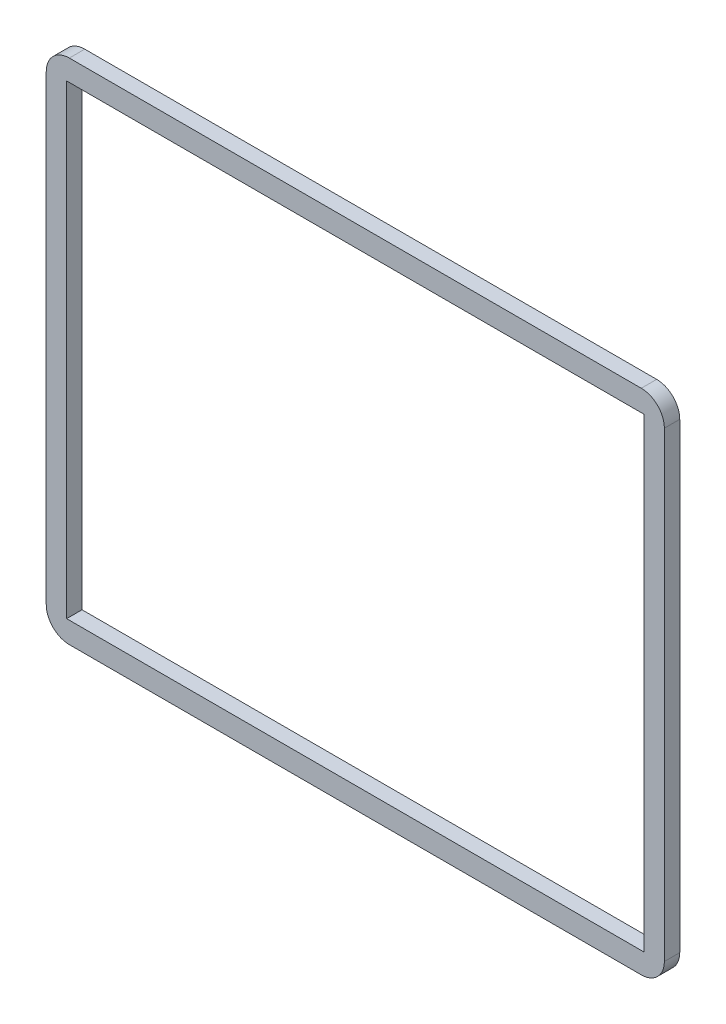
ISO-10303-21;
HEADER;
FILE_DESCRIPTION(('STEP AP214'),'2;1');
FILE_NAME('part.step','',(''),(''),'','','');
FILE_SCHEMA(('AUTOMOTIVE_DESIGN { 1 0 10303 214 1 1 1 1 }'));
ENDSEC;
DATA;
#1=APPLICATION_CONTEXT('core data for automotive mechanical design processes');
#2=APPLICATION_PROTOCOL_DEFINITION('international standard','automotive_design',2000,#1);
#3=PRODUCT_CONTEXT('',#1,'mechanical');
#4=PRODUCT('Part','Part','',(#3));
#5=PRODUCT_RELATED_PRODUCT_CATEGORY('part','',(#4));
#6=PRODUCT_DEFINITION_FORMATION('','',#4);
#7=PRODUCT_DEFINITION_CONTEXT('part definition',#1,'design');
#8=PRODUCT_DEFINITION('design','',#6,#7);
#9=PRODUCT_DEFINITION_SHAPE('','',#8);
#10=(LENGTH_UNIT() NAMED_UNIT(*) SI_UNIT(.MILLI.,.METRE.));
#11=(NAMED_UNIT(*) PLANE_ANGLE_UNIT() SI_UNIT($,.RADIAN.));
#12=(NAMED_UNIT(*) SI_UNIT($,.STERADIAN.) SOLID_ANGLE_UNIT());
#13=UNCERTAINTY_MEASURE_WITH_UNIT(LENGTH_MEASURE(1.E-05),#10,'distance_accuracy_value','');
#14=(GEOMETRIC_REPRESENTATION_CONTEXT(3) GLOBAL_UNCERTAINTY_ASSIGNED_CONTEXT((#13)) GLOBAL_UNIT_ASSIGNED_CONTEXT((#10,
#11,#12)) REPRESENTATION_CONTEXT('',''));
#15=CARTESIAN_POINT('',(0.,0.,0.));
#16=DIRECTION('',(0.,0.,1.));
#17=DIRECTION('',(1.,0.,0.));
#18=AXIS2_PLACEMENT_3D('',#15,#16,#17);
#19=CARTESIAN_POINT('',(0.,0.,2.));
#20=DIRECTION('',(1.,0.,0.));
#21=DIRECTION('',(0.,0.,-1.));
#22=AXIS2_PLACEMENT_3D('',#19,#20,#21);
#23=PLANE('',#22);
#24=DIRECTION('',(0.,-1.,0.));
#25=VECTOR('',#24,1.);
#26=CARTESIAN_POINT('',(0.,0.,0.));
#27=LINE('',#26,#25);
#28=CARTESIAN_POINT('',(0.,63.,0.));
#29=VERTEX_POINT('',#28);
#30=CARTESIAN_POINT('',(0.,3.,0.));
#31=VERTEX_POINT('',#30);
#32=EDGE_CURVE('E153',#29,#31,#27,.T.);
#33=ORIENTED_EDGE('',*,*,#32,.T.);
#34=DIRECTION('',(0.,0.,-1.));
#35=VECTOR('',#34,1.);
#36=CARTESIAN_POINT('',(0.,3.,2.));
#37=LINE('',#36,#35);
#38=CARTESIAN_POINT('',(0.,3.,2.));
#39=VERTEX_POINT('',#38);
#40=EDGE_CURVE('E11',#31,#39,#37,.F.);
#41=ORIENTED_EDGE('',*,*,#40,.T.);
#42=DIRECTION('',(0.,-1.,0.));
#43=VECTOR('',#42,1.);
#44=CARTESIAN_POINT('',(0.,0.,2.));
#45=LINE('',#44,#43);
#46=CARTESIAN_POINT('',(0.,63.,2.));
#47=VERTEX_POINT('',#46);
#48=EDGE_CURVE('E157',#47,#39,#45,.T.);
#49=ORIENTED_EDGE('',*,*,#48,.F.);
#50=DIRECTION('',(0.,0.,-1.));
#51=VECTOR('',#50,1.);
#52=CARTESIAN_POINT('',(0.,63.,2.));
#53=LINE('',#52,#51);
#54=EDGE_CURVE('E40',#47,#29,#53,.T.);
#55=ORIENTED_EDGE('',*,*,#54,.T.);
#56=EDGE_LOOP('',(#33,#41,#49,#55));
#57=FACE_BOUND('',#56,.T.);
#58=ADVANCED_FACE('F32',(#57),#23,.F.);
#59=CARTESIAN_POINT('',(0.,0.,2.));
#60=DIRECTION('',(0.,1.,0.));
#61=DIRECTION('',(0.,0.,1.));
#62=AXIS2_PLACEMENT_3D('',#59,#60,#61);
#63=PLANE('',#62);
#64=DIRECTION('',(1.,0.,0.));
#65=VECTOR('',#64,1.);
#66=CARTESIAN_POINT('',(0.,0.,0.));
#67=LINE('',#66,#65);
#68=CARTESIAN_POINT('',(3.,0.,0.));
#69=VERTEX_POINT('',#68);
#70=CARTESIAN_POINT('',(77.3,0.,0.));
#71=VERTEX_POINT('',#70);
#72=EDGE_CURVE('E173',#69,#71,#67,.T.);
#73=ORIENTED_EDGE('',*,*,#72,.T.);
#74=DIRECTION('',(0.,0.,-1.));
#75=VECTOR('',#74,1.);
#76=CARTESIAN_POINT('',(77.3,0.,2.));
#77=LINE('',#76,#75);
#78=CARTESIAN_POINT('',(77.3,0.,2.));
#79=VERTEX_POINT('',#78);
#80=EDGE_CURVE('E209',#71,#79,#77,.F.);
#81=ORIENTED_EDGE('',*,*,#80,.T.);
#82=DIRECTION('',(1.,0.,0.));
#83=VECTOR('',#82,1.);
#84=CARTESIAN_POINT('',(0.,0.,2.));
#85=LINE('',#84,#83);
#86=CARTESIAN_POINT('',(3.,0.,2.));
#87=VERTEX_POINT('',#86);
#88=EDGE_CURVE('E160',#87,#79,#85,.T.);
#89=ORIENTED_EDGE('',*,*,#88,.F.);
#90=DIRECTION('',(0.,0.,-1.));
#91=VECTOR('',#90,1.);
#92=CARTESIAN_POINT('',(3.,0.,2.));
#93=LINE('',#92,#91);
#94=EDGE_CURVE('E206',#87,#69,#93,.T.);
#95=ORIENTED_EDGE('',*,*,#94,.T.);
#96=EDGE_LOOP('',(#73,#81,#89,#95));
#97=FACE_BOUND('',#96,.T.);
#98=ADVANCED_FACE('F226',(#97),#63,.F.);
#99=CARTESIAN_POINT('',(80.3,0.,2.));
#100=DIRECTION('',(-1.,0.,0.));
#101=DIRECTION('',(0.,0.,1.));
#102=AXIS2_PLACEMENT_3D('',#99,#100,#101);
#103=PLANE('',#102);
#104=DIRECTION('',(0.,1.,0.));
#105=VECTOR('',#104,1.);
#106=CARTESIAN_POINT('',(80.3,0.,0.));
#107=LINE('',#106,#105);
#108=CARTESIAN_POINT('',(80.3,3.,0.));
#109=VERTEX_POINT('',#108);
#110=CARTESIAN_POINT('',(80.3,63.,0.));
#111=VERTEX_POINT('',#110);
#112=EDGE_CURVE('E176',#109,#111,#107,.T.);
#113=ORIENTED_EDGE('',*,*,#112,.T.);
#114=DIRECTION('',(0.,0.,-1.));
#115=VECTOR('',#114,1.);
#116=CARTESIAN_POINT('',(80.3,63.,2.));
#117=LINE('',#116,#115);
#118=CARTESIAN_POINT('',(80.3,63.,2.));
#119=VERTEX_POINT('',#118);
#120=EDGE_CURVE('E196',#111,#119,#117,.F.);
#121=ORIENTED_EDGE('',*,*,#120,.T.);
#122=DIRECTION('',(0.,1.,0.));
#123=VECTOR('',#122,1.);
#124=CARTESIAN_POINT('',(80.3,0.,2.));
#125=LINE('',#124,#123);
#126=CARTESIAN_POINT('',(80.3,3.,2.));
#127=VERTEX_POINT('',#126);
#128=EDGE_CURVE('E164',#127,#119,#125,.T.);
#129=ORIENTED_EDGE('',*,*,#128,.F.);
#130=DIRECTION('',(0.,0.,-1.));
#131=VECTOR('',#130,1.);
#132=CARTESIAN_POINT('',(80.3,3.,2.));
#133=LINE('',#132,#131);
#134=EDGE_CURVE('E193',#127,#109,#133,.T.);
#135=ORIENTED_EDGE('',*,*,#134,.T.);
#136=EDGE_LOOP('',(#113,#121,#129,#135));
#137=FACE_BOUND('',#136,.T.);
#138=ADVANCED_FACE('F237',(#137),#103,.F.);
#139=CARTESIAN_POINT('',(0.,66.,2.));
#140=DIRECTION('',(0.,-1.,0.));
#141=DIRECTION('',(0.,0.,-1.));
#142=AXIS2_PLACEMENT_3D('',#139,#140,#141);
#143=PLANE('',#142);
#144=DIRECTION('',(-1.,0.,0.));
#145=VECTOR('',#144,1.);
#146=CARTESIAN_POINT('',(0.,66.,2.));
#147=LINE('',#146,#145);
#148=CARTESIAN_POINT('',(77.3,66.,2.));
#149=VERTEX_POINT('',#148);
#150=CARTESIAN_POINT('',(3.,66.,2.));
#151=VERTEX_POINT('',#150);
#152=EDGE_CURVE('E167',#149,#151,#147,.T.);
#153=ORIENTED_EDGE('',*,*,#152,.F.);
#154=DIRECTION('',(0.,0.,-1.));
#155=VECTOR('',#154,1.);
#156=CARTESIAN_POINT('',(77.3,66.,2.));
#157=LINE('',#156,#155);
#158=CARTESIAN_POINT('',(77.3,66.,0.));
#159=VERTEX_POINT('',#158);
#160=EDGE_CURVE('E182',#149,#159,#157,.T.);
#161=ORIENTED_EDGE('',*,*,#160,.T.);
#162=DIRECTION('',(-1.,0.,0.));
#163=VECTOR('',#162,1.);
#164=CARTESIAN_POINT('',(0.,66.,0.));
#165=LINE('',#164,#163);
#166=CARTESIAN_POINT('',(3.,66.,0.));
#167=VERTEX_POINT('',#166);
#168=EDGE_CURVE('E161',#159,#167,#165,.T.);
#169=ORIENTED_EDGE('',*,*,#168,.T.);
#170=DIRECTION('',(0.,0.,-1.));
#171=VECTOR('',#170,1.);
#172=CARTESIAN_POINT('',(3.,66.,2.));
#173=LINE('',#172,#171);
#174=EDGE_CURVE('E170',#167,#151,#173,.F.);
#175=ORIENTED_EDGE('',*,*,#174,.T.);
#176=EDGE_LOOP('',(#153,#161,#169,#175));
#177=FACE_BOUND('',#176,.T.);
#178=ADVANCED_FACE('F245',(#177),#143,.F.);
#179=CARTESIAN_POINT('',(0.,0.,2.));
#180=DIRECTION('',(0.,0.,-1.));
#181=DIRECTION('',(-1.,0.,0.));
#182=AXIS2_PLACEMENT_3D('',#179,#180,#181);
#183=PLANE('',#182);
#184=DIRECTION('',(1.,0.,0.));
#185=VECTOR('',#184,1.);
#186=CARTESIAN_POINT('',(2.65000000000001,2.75,2.));
#187=LINE('',#186,#185);
#188=CARTESIAN_POINT('',(2.65000000000001,2.75,2.));
#189=VERTEX_POINT('',#188);
#190=CARTESIAN_POINT('',(77.65,2.75000000000001,2.));
#191=VERTEX_POINT('',#190);
#192=EDGE_CURVE('E147',#189,#191,#187,.T.);
#193=ORIENTED_EDGE('',*,*,#192,.F.);
#194=DIRECTION('',(0.,-1.,0.));
#195=VECTOR('',#194,1.);
#196=CARTESIAN_POINT('',(2.65000000000001,2.75,2.));
#197=LINE('',#196,#195);
#198=CARTESIAN_POINT('',(2.65000000000001,63.25,2.));
#199=VERTEX_POINT('',#198);
#200=EDGE_CURVE('E47',#199,#189,#197,.T.);
#201=ORIENTED_EDGE('',*,*,#200,.F.);
#202=DIRECTION('',(-1.,0.,0.));
#203=VECTOR('',#202,1.);
#204=CARTESIAN_POINT('',(2.65000000000001,63.25,2.));
#205=LINE('',#204,#203);
#206=CARTESIAN_POINT('',(77.65,63.25,2.));
#207=VERTEX_POINT('',#206);
#208=EDGE_CURVE('E138',#207,#199,#205,.T.);
#209=ORIENTED_EDGE('',*,*,#208,.F.);
#210=DIRECTION('',(0.,1.,0.));
#211=VECTOR('',#210,1.);
#212=CARTESIAN_POINT('',(77.65,2.75000000000001,2.));
#213=LINE('',#212,#211);
#214=EDGE_CURVE('E141',#191,#207,#213,.T.);
#215=ORIENTED_EDGE('',*,*,#214,.F.);
#216=EDGE_LOOP('',(#193,#201,#209,#215));
#217=FACE_BOUND('',#216,.T.);
#218=ORIENTED_EDGE('',*,*,#128,.T.);
#219=CARTESIAN_POINT('',(77.3,63.,2.));
#220=DIRECTION('',(0.,0.,-1.));
#221=DIRECTION('',(-1.,0.,0.));
#222=AXIS2_PLACEMENT_3D('',#219,#220,#221);
#223=CIRCLE('',#222,3.);
#224=EDGE_CURVE('E204',#119,#149,#223,.F.);
#225=ORIENTED_EDGE('',*,*,#224,.T.);
#226=ORIENTED_EDGE('',*,*,#152,.T.);
#227=CARTESIAN_POINT('',(3.,63.,2.));
#228=DIRECTION('',(0.,0.,-1.));
#229=DIRECTION('',(-1.,0.,0.));
#230=AXIS2_PLACEMENT_3D('',#227,#228,#229);
#231=CIRCLE('',#230,3.);
#232=EDGE_CURVE('E198',#151,#47,#231,.F.);
#233=ORIENTED_EDGE('',*,*,#232,.T.);
#234=ORIENTED_EDGE('',*,*,#48,.T.);
#235=CARTESIAN_POINT('',(3.,3.,2.));
#236=DIRECTION('',(0.,0.,-1.));
#237=DIRECTION('',(-1.,0.,0.));
#238=AXIS2_PLACEMENT_3D('',#235,#236,#237);
#239=CIRCLE('',#238,3.);
#240=EDGE_CURVE('E200',#39,#87,#239,.F.);
#241=ORIENTED_EDGE('',*,*,#240,.T.);
#242=ORIENTED_EDGE('',*,*,#88,.T.);
#243=CARTESIAN_POINT('',(77.3,3.,2.));
#244=DIRECTION('',(0.,0.,-1.));
#245=DIRECTION('',(-1.,0.,0.));
#246=AXIS2_PLACEMENT_3D('',#243,#244,#245);
#247=CIRCLE('',#246,3.);
#248=EDGE_CURVE('E202',#79,#127,#247,.F.);
#249=ORIENTED_EDGE('',*,*,#248,.T.);
#250=EDGE_LOOP('',(#218,#225,#226,#233,#234,#241,#242,#249));
#251=FACE_BOUND('',#250,.T.);
#252=ADVANCED_FACE('F230',(#217,#251),#183,.F.);
#253=CARTESIAN_POINT('',(0.,0.,0.));
#254=DIRECTION('',(0.,0.,-1.));
#255=DIRECTION('',(-1.,0.,0.));
#256=AXIS2_PLACEMENT_3D('',#253,#254,#255);
#257=PLANE('',#256);
#258=DIRECTION('',(0.,-1.,0.));
#259=VECTOR('',#258,1.);
#260=CARTESIAN_POINT('',(2.65000000000001,2.75,0.));
#261=LINE('',#260,#259);
#262=CARTESIAN_POINT('',(2.65000000000001,63.25,0.));
#263=VERTEX_POINT('',#262);
#264=CARTESIAN_POINT('',(2.65000000000001,2.75,0.));
#265=VERTEX_POINT('',#264);
#266=EDGE_CURVE('E122',#263,#265,#261,.T.);
#267=ORIENTED_EDGE('',*,*,#266,.T.);
#268=DIRECTION('',(1.,0.,0.));
#269=VECTOR('',#268,1.);
#270=CARTESIAN_POINT('',(2.65000000000001,2.75,0.));
#271=LINE('',#270,#269);
#272=CARTESIAN_POINT('',(77.65,2.75000000000001,0.));
#273=VERTEX_POINT('',#272);
#274=EDGE_CURVE('E131',#265,#273,#271,.T.);
#275=ORIENTED_EDGE('',*,*,#274,.T.);
#276=DIRECTION('',(0.,1.,0.));
#277=VECTOR('',#276,1.);
#278=CARTESIAN_POINT('',(77.65,2.75000000000001,0.));
#279=LINE('',#278,#277);
#280=CARTESIAN_POINT('',(77.65,63.25,0.));
#281=VERTEX_POINT('',#280);
#282=EDGE_CURVE('E55',#273,#281,#279,.T.);
#283=ORIENTED_EDGE('',*,*,#282,.T.);
#284=DIRECTION('',(-1.,0.,0.));
#285=VECTOR('',#284,1.);
#286=CARTESIAN_POINT('',(2.65000000000001,63.25,0.));
#287=LINE('',#286,#285);
#288=EDGE_CURVE('E128',#281,#263,#287,.T.);
#289=ORIENTED_EDGE('',*,*,#288,.T.);
#290=EDGE_LOOP('',(#267,#275,#283,#289));
#291=FACE_BOUND('',#290,.T.);
#292=ORIENTED_EDGE('',*,*,#168,.F.);
#293=CARTESIAN_POINT('',(77.3,63.,0.));
#294=DIRECTION('',(0.,0.,-1.));
#295=DIRECTION('',(-1.,0.,0.));
#296=AXIS2_PLACEMENT_3D('',#293,#294,#295);
#297=CIRCLE('',#296,3.);
#298=EDGE_CURVE('E191',#159,#111,#297,.T.);
#299=ORIENTED_EDGE('',*,*,#298,.T.);
#300=ORIENTED_EDGE('',*,*,#112,.F.);
#301=CARTESIAN_POINT('',(77.3,3.,0.));
#302=DIRECTION('',(0.,0.,-1.));
#303=DIRECTION('',(-1.,0.,0.));
#304=AXIS2_PLACEMENT_3D('',#301,#302,#303);
#305=CIRCLE('',#304,3.);
#306=EDGE_CURVE('E189',#109,#71,#305,.T.);
#307=ORIENTED_EDGE('',*,*,#306,.T.);
#308=ORIENTED_EDGE('',*,*,#72,.F.);
#309=CARTESIAN_POINT('',(3.,3.,0.));
#310=DIRECTION('',(0.,0.,-1.));
#311=DIRECTION('',(-1.,0.,0.));
#312=AXIS2_PLACEMENT_3D('',#309,#310,#311);
#313=CIRCLE('',#312,3.);
#314=EDGE_CURVE('E187',#69,#31,#313,.T.);
#315=ORIENTED_EDGE('',*,*,#314,.T.);
#316=ORIENTED_EDGE('',*,*,#32,.F.);
#317=CARTESIAN_POINT('',(3.,63.,0.));
#318=DIRECTION('',(0.,0.,-1.));
#319=DIRECTION('',(-1.,0.,0.));
#320=AXIS2_PLACEMENT_3D('',#317,#318,#319);
#321=CIRCLE('',#320,3.);
#322=EDGE_CURVE('E185',#29,#167,#321,.T.);
#323=ORIENTED_EDGE('',*,*,#322,.T.);
#324=EDGE_LOOP('',(#292,#299,#300,#307,#308,#315,#316,#323));
#325=FACE_BOUND('',#324,.T.);
#326=ADVANCED_FACE('F135',(#291,#325),#257,.T.);
#327=CARTESIAN_POINT('',(77.3,63.,2.));
#328=DIRECTION('',(0.,0.,-1.));
#329=DIRECTION('',(-1.,0.,0.));
#330=AXIS2_PLACEMENT_3D('',#327,#328,#329);
#331=CYLINDRICAL_SURFACE('',#330,3.);
#332=ORIENTED_EDGE('',*,*,#224,.F.);
#333=ORIENTED_EDGE('',*,*,#120,.F.);
#334=ORIENTED_EDGE('',*,*,#298,.F.);
#335=ORIENTED_EDGE('',*,*,#160,.F.);
#336=EDGE_LOOP('',(#332,#333,#334,#335));
#337=FACE_BOUND('',#336,.T.);
#338=ADVANCED_FACE('F242',(#337),#331,.T.);
#339=CARTESIAN_POINT('',(77.3,3.,2.));
#340=DIRECTION('',(0.,0.,-1.));
#341=DIRECTION('',(-1.,0.,0.));
#342=AXIS2_PLACEMENT_3D('',#339,#340,#341);
#343=CYLINDRICAL_SURFACE('',#342,3.);
#344=ORIENTED_EDGE('',*,*,#248,.F.);
#345=ORIENTED_EDGE('',*,*,#80,.F.);
#346=ORIENTED_EDGE('',*,*,#306,.F.);
#347=ORIENTED_EDGE('',*,*,#134,.F.);
#348=EDGE_LOOP('',(#344,#345,#346,#347));
#349=FACE_BOUND('',#348,.T.);
#350=ADVANCED_FACE('F234',(#349),#343,.T.);
#351=CARTESIAN_POINT('',(3.,3.,2.));
#352=DIRECTION('',(0.,0.,-1.));
#353=DIRECTION('',(-1.,0.,0.));
#354=AXIS2_PLACEMENT_3D('',#351,#352,#353);
#355=CYLINDRICAL_SURFACE('',#354,3.);
#356=ORIENTED_EDGE('',*,*,#240,.F.);
#357=ORIENTED_EDGE('',*,*,#40,.F.);
#358=ORIENTED_EDGE('',*,*,#314,.F.);
#359=ORIENTED_EDGE('',*,*,#94,.F.);
#360=EDGE_LOOP('',(#356,#357,#358,#359));
#361=FACE_BOUND('',#360,.T.);
#362=ADVANCED_FACE('F223',(#361),#355,.T.);
#363=CARTESIAN_POINT('',(3.,63.,2.));
#364=DIRECTION('',(0.,0.,-1.));
#365=DIRECTION('',(-1.,0.,0.));
#366=AXIS2_PLACEMENT_3D('',#363,#364,#365);
#367=CYLINDRICAL_SURFACE('',#366,3.);
#368=ORIENTED_EDGE('',*,*,#232,.F.);
#369=ORIENTED_EDGE('',*,*,#174,.F.);
#370=ORIENTED_EDGE('',*,*,#322,.F.);
#371=ORIENTED_EDGE('',*,*,#54,.F.);
#372=EDGE_LOOP('',(#368,#369,#370,#371));
#373=FACE_BOUND('',#372,.T.);
#374=ADVANCED_FACE('F34',(#373),#367,.T.);
#375=CARTESIAN_POINT('',(2.65000000000001,2.75,0.));
#376=DIRECTION('',(-1.,0.,0.));
#377=DIRECTION('',(0.,-1.,0.));
#378=AXIS2_PLACEMENT_3D('',#375,#376,#377);
#379=PLANE('',#378);
#380=ORIENTED_EDGE('',*,*,#200,.T.);
#381=DIRECTION('',(0.,0.,1.));
#382=VECTOR('',#381,1.);
#383=CARTESIAN_POINT('',(2.65000000000001,2.75,0.));
#384=LINE('',#383,#382);
#385=EDGE_CURVE('E118',#265,#189,#384,.T.);
#386=ORIENTED_EDGE('',*,*,#385,.F.);
#387=ORIENTED_EDGE('',*,*,#266,.F.);
#388=DIRECTION('',(0.,0.,1.));
#389=VECTOR('',#388,1.);
#390=CARTESIAN_POINT('',(2.65000000000001,63.25,0.));
#391=LINE('',#390,#389);
#392=EDGE_CURVE('E151',#263,#199,#391,.T.);
#393=ORIENTED_EDGE('',*,*,#392,.T.);
#394=EDGE_LOOP('',(#380,#386,#387,#393));
#395=FACE_BOUND('',#394,.T.);
#396=ADVANCED_FACE('F120',(#395),#379,.F.);
#397=CARTESIAN_POINT('',(2.65000000000001,63.25,0.));
#398=DIRECTION('',(0.,1.,0.));
#399=DIRECTION('',(-1.,0.,0.));
#400=AXIS2_PLACEMENT_3D('',#397,#398,#399);
#401=PLANE('',#400);
#402=ORIENTED_EDGE('',*,*,#208,.T.);
#403=ORIENTED_EDGE('',*,*,#392,.F.);
#404=ORIENTED_EDGE('',*,*,#288,.F.);
#405=DIRECTION('',(0.,0.,1.));
#406=VECTOR('',#405,1.);
#407=CARTESIAN_POINT('',(77.65,63.25,0.));
#408=LINE('',#407,#406);
#409=EDGE_CURVE('E154',#281,#207,#408,.T.);
#410=ORIENTED_EDGE('',*,*,#409,.T.);
#411=EDGE_LOOP('',(#402,#403,#404,#410));
#412=FACE_BOUND('',#411,.T.);
#413=ADVANCED_FACE('F252',(#412),#401,.F.);
#414=CARTESIAN_POINT('',(77.65,2.75000000000001,0.));
#415=DIRECTION('',(1.,0.,0.));
#416=DIRECTION('',(0.,1.,0.));
#417=AXIS2_PLACEMENT_3D('',#414,#415,#416);
#418=PLANE('',#417);
#419=ORIENTED_EDGE('',*,*,#214,.T.);
#420=ORIENTED_EDGE('',*,*,#409,.F.);
#421=ORIENTED_EDGE('',*,*,#282,.F.);
#422=DIRECTION('',(0.,0.,1.));
#423=VECTOR('',#422,1.);
#424=CARTESIAN_POINT('',(77.65,2.75000000000001,0.));
#425=LINE('',#424,#423);
#426=EDGE_CURVE('E127',#273,#191,#425,.T.);
#427=ORIENTED_EDGE('',*,*,#426,.T.);
#428=EDGE_LOOP('',(#419,#420,#421,#427));
#429=FACE_BOUND('',#428,.T.);
#430=ADVANCED_FACE('F312',(#429),#418,.F.);
#431=CARTESIAN_POINT('',(2.65000000000001,2.75,0.));
#432=DIRECTION('',(0.,-1.,0.));
#433=DIRECTION('',(1.,0.,0.));
#434=AXIS2_PLACEMENT_3D('',#431,#432,#433);
#435=PLANE('',#434);
#436=ORIENTED_EDGE('',*,*,#192,.T.);
#437=ORIENTED_EDGE('',*,*,#426,.F.);
#438=ORIENTED_EDGE('',*,*,#274,.F.);
#439=ORIENTED_EDGE('',*,*,#385,.T.);
#440=EDGE_LOOP('',(#436,#437,#438,#439));
#441=FACE_BOUND('',#440,.T.);
#442=ADVANCED_FACE('F132',(#441),#435,.F.);
#443=CLOSED_SHELL('',(#58,#98,#138,#178,#252,#326,#338,#350,#362,#374,#396,#413,#430,#442));
#444=MANIFOLD_SOLID_BREP('B2',#443);
#445=ADVANCED_BREP_SHAPE_REPRESENTATION('',(#18,#444),#14);
#446=SHAPE_DEFINITION_REPRESENTATION(#9,#445);
ENDSEC;
END-ISO-10303-21;
